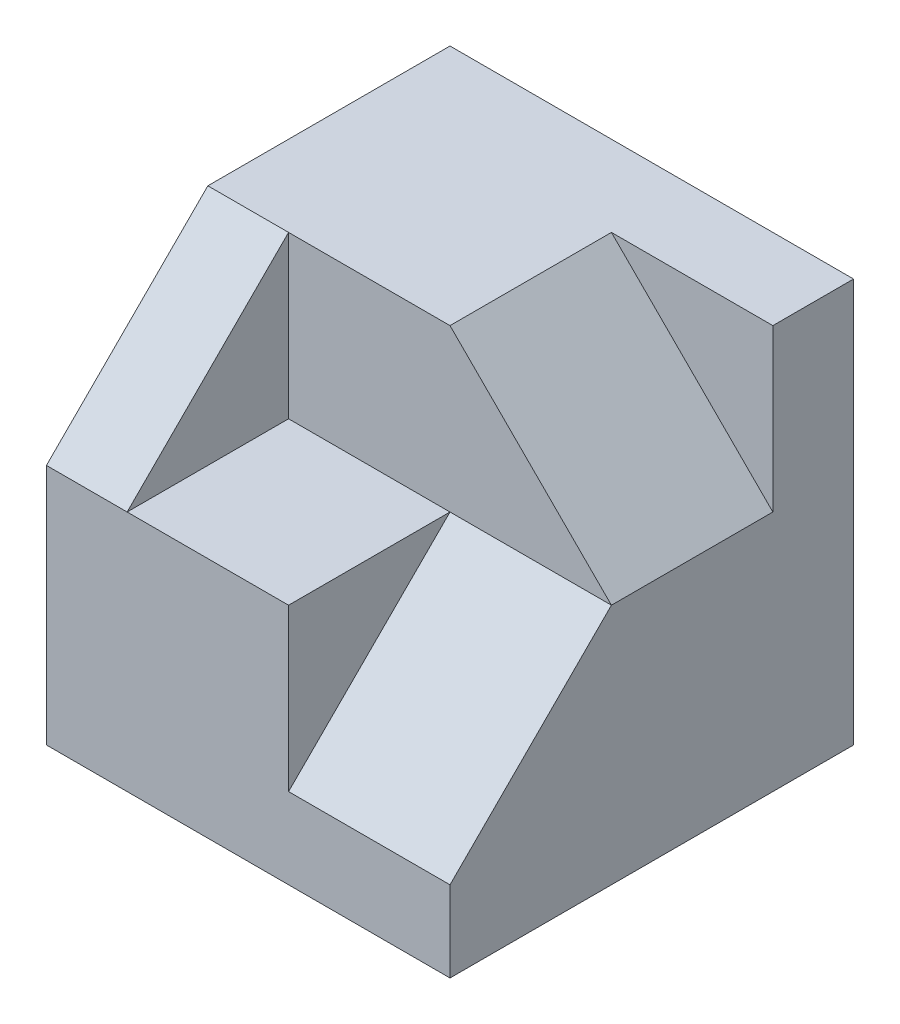
ISO-10303-21;
HEADER;
FILE_DESCRIPTION(('STEP AP214'),'2;1');
FILE_NAME('part.step','',(''),(''),'','','');
FILE_SCHEMA(('AUTOMOTIVE_DESIGN { 1 0 10303 214 1 1 1 1 }'));
ENDSEC;
DATA;
#1=APPLICATION_CONTEXT('core data for automotive mechanical design processes');
#2=APPLICATION_PROTOCOL_DEFINITION('international standard','automotive_design',2000,#1);
#3=PRODUCT_CONTEXT('',#1,'mechanical');
#4=PRODUCT('Part','Part','',(#3));
#5=PRODUCT_RELATED_PRODUCT_CATEGORY('part','',(#4));
#6=PRODUCT_DEFINITION_FORMATION('','',#4);
#7=PRODUCT_DEFINITION_CONTEXT('part definition',#1,'design');
#8=PRODUCT_DEFINITION('design','',#6,#7);
#9=PRODUCT_DEFINITION_SHAPE('','',#8);
#10=(LENGTH_UNIT() NAMED_UNIT(*) SI_UNIT(.MILLI.,.METRE.));
#11=(NAMED_UNIT(*) PLANE_ANGLE_UNIT() SI_UNIT($,.RADIAN.));
#12=(NAMED_UNIT(*) SI_UNIT($,.STERADIAN.) SOLID_ANGLE_UNIT());
#13=UNCERTAINTY_MEASURE_WITH_UNIT(LENGTH_MEASURE(1.E-05),#10,'distance_accuracy_value','');
#14=(GEOMETRIC_REPRESENTATION_CONTEXT(3) GLOBAL_UNCERTAINTY_ASSIGNED_CONTEXT((#13)) GLOBAL_UNIT_ASSIGNED_CONTEXT((#10,
#11,#12)) REPRESENTATION_CONTEXT('',''));
#15=CARTESIAN_POINT('',(0.,0.,0.));
#16=DIRECTION('',(0.,0.,1.));
#17=DIRECTION('',(1.,0.,0.));
#18=AXIS2_PLACEMENT_3D('',#15,#16,#17);
#19=CARTESIAN_POINT('',(0.,0.5,0.));
#20=DIRECTION('',(0.,1.,0.));
#21=DIRECTION('',(-1.,0.,0.));
#22=AXIS2_PLACEMENT_3D('',#19,#20,#21);
#23=PLANE('',#22);
#24=DIRECTION('',(1.,0.,0.));
#25=VECTOR('',#24,1.);
#26=CARTESIAN_POINT('',(-1.5,0.5,5.));
#27=LINE('',#26,#25);
#28=CARTESIAN_POINT('',(-1.5,0.499999999999999,5.));
#29=VERTEX_POINT('',#28);
#30=CARTESIAN_POINT('',(0.5,0.5,5.));
#31=VERTEX_POINT('',#30);
#32=EDGE_CURVE('E128',#29,#31,#27,.T.);
#33=ORIENTED_EDGE('',*,*,#32,.T.);
#34=DIRECTION('',(0.,0.,1.));
#35=VECTOR('',#34,1.);
#36=CARTESIAN_POINT('',(0.5,0.5,5.));
#37=LINE('',#36,#35);
#38=CARTESIAN_POINT('',(0.5,0.5,3.));
#39=VERTEX_POINT('',#38);
#40=EDGE_CURVE('E190',#39,#31,#37,.T.);
#41=ORIENTED_EDGE('',*,*,#40,.F.);
#42=DIRECTION('',(-1.,0.,0.));
#43=VECTOR('',#42,1.);
#44=CARTESIAN_POINT('',(2.5,0.5,3.));
#45=LINE('',#44,#43);
#46=CARTESIAN_POINT('',(-1.5,0.499999999999999,3.));
#47=VERTEX_POINT('',#46);
#48=EDGE_CURVE('E198',#39,#47,#45,.T.);
#49=ORIENTED_EDGE('',*,*,#48,.T.);
#50=DIRECTION('',(0.,0.,1.));
#51=VECTOR('',#50,1.);
#52=CARTESIAN_POINT('',(-1.5,0.499999999999999,3.));
#53=LINE('',#52,#51);
#54=EDGE_CURVE('E201',#47,#29,#53,.T.);
#55=ORIENTED_EDGE('',*,*,#54,.T.);
#56=EDGE_LOOP('',(#33,#41,#49,#55));
#57=FACE_BOUND('',#56,.T.);
#58=ADVANCED_FACE('F33',(#57),#23,.T.);
#59=CARTESIAN_POINT('',(-2.5,-2.5,5.));
#60=DIRECTION('',(1.,0.,0.));
#61=DIRECTION('',(0.,0.,-1.));
#62=AXIS2_PLACEMENT_3D('',#59,#60,#61);
#63=PLANE('',#62);
#64=DIRECTION('',(0.,-1.,0.));
#65=VECTOR('',#64,1.);
#66=CARTESIAN_POINT('',(-2.5,-2.5,5.));
#67=LINE('',#66,#65);
#68=CARTESIAN_POINT('',(-2.5,0.499999999999999,5.));
#69=VERTEX_POINT('',#68);
#70=CARTESIAN_POINT('',(-2.5,-2.5,5.));
#71=VERTEX_POINT('',#70);
#72=EDGE_CURVE('E124',#69,#71,#67,.T.);
#73=ORIENTED_EDGE('',*,*,#72,.F.);
#74=DIRECTION('',(0.,0.707106781186548,-0.707106781186548));
#75=VECTOR('',#74,1.);
#76=CARTESIAN_POINT('',(-2.5,2.5,3.));
#77=LINE('',#76,#75);
#78=CARTESIAN_POINT('',(-2.5,2.5,3.));
#79=VERTEX_POINT('',#78);
#80=EDGE_CURVE('E109',#69,#79,#77,.T.);
#81=ORIENTED_EDGE('',*,*,#80,.T.);
#82=DIRECTION('',(0.,0.,-1.));
#83=VECTOR('',#82,1.);
#84=CARTESIAN_POINT('',(-2.5,2.5,5.));
#85=LINE('',#84,#83);
#86=CARTESIAN_POINT('',(-2.5,2.5,0.));
#87=VERTEX_POINT('',#86);
#88=EDGE_CURVE('E145',#79,#87,#85,.T.);
#89=ORIENTED_EDGE('',*,*,#88,.T.);
#90=DIRECTION('',(0.,-1.,0.));
#91=VECTOR('',#90,1.);
#92=CARTESIAN_POINT('',(-2.5,-2.5,0.));
#93=LINE('',#92,#91);
#94=CARTESIAN_POINT('',(-2.5,-2.5,0.));
#95=VERTEX_POINT('',#94);
#96=EDGE_CURVE('E146',#87,#95,#93,.T.);
#97=ORIENTED_EDGE('',*,*,#96,.T.);
#98=DIRECTION('',(0.,0.,-1.));
#99=VECTOR('',#98,1.);
#100=CARTESIAN_POINT('',(-2.5,-2.5,5.));
#101=LINE('',#100,#99);
#102=EDGE_CURVE('E11',#71,#95,#101,.T.);
#103=ORIENTED_EDGE('',*,*,#102,.F.);
#104=EDGE_LOOP('',(#73,#81,#89,#97,#103));
#105=FACE_BOUND('',#104,.T.);
#106=ADVANCED_FACE('F35',(#105),#63,.F.);
#107=CARTESIAN_POINT('',(2.5,-2.5,5.));
#108=DIRECTION('',(0.,1.,0.));
#109=DIRECTION('',(-1.,0.,0.));
#110=AXIS2_PLACEMENT_3D('',#107,#108,#109);
#111=PLANE('',#110);
#112=DIRECTION('',(1.,0.,0.));
#113=VECTOR('',#112,1.);
#114=CARTESIAN_POINT('',(2.5,-2.5,0.));
#115=LINE('',#114,#113);
#116=CARTESIAN_POINT('',(2.5,-2.5,0.));
#117=VERTEX_POINT('',#116);
#118=EDGE_CURVE('E148',#95,#117,#115,.T.);
#119=ORIENTED_EDGE('',*,*,#118,.T.);
#120=DIRECTION('',(0.,0.,-1.));
#121=VECTOR('',#120,1.);
#122=CARTESIAN_POINT('',(2.5,-2.5,5.));
#123=LINE('',#122,#121);
#124=CARTESIAN_POINT('',(2.5,-2.5,5.));
#125=VERTEX_POINT('',#124);
#126=EDGE_CURVE('E41',#125,#117,#123,.T.);
#127=ORIENTED_EDGE('',*,*,#126,.F.);
#128=DIRECTION('',(1.,0.,0.));
#129=VECTOR('',#128,1.);
#130=CARTESIAN_POINT('',(2.5,-2.5,5.));
#131=LINE('',#130,#129);
#132=EDGE_CURVE('E132',#71,#125,#131,.T.);
#133=ORIENTED_EDGE('',*,*,#132,.F.);
#134=ORIENTED_EDGE('',*,*,#102,.T.);
#135=EDGE_LOOP('',(#119,#127,#133,#134));
#136=FACE_BOUND('',#135,.T.);
#137=ADVANCED_FACE('F225',(#136),#111,.F.);
#138=CARTESIAN_POINT('',(2.5,-2.5,5.));
#139=DIRECTION('',(-1.,0.,0.));
#140=DIRECTION('',(0.,0.,1.));
#141=AXIS2_PLACEMENT_3D('',#138,#139,#140);
#142=PLANE('',#141);
#143=DIRECTION('',(0.,1.,0.));
#144=VECTOR('',#143,1.);
#145=CARTESIAN_POINT('',(2.5,0.5,1.));
#146=LINE('',#145,#144);
#147=CARTESIAN_POINT('',(2.5,0.5,1.));
#148=VERTEX_POINT('',#147);
#149=CARTESIAN_POINT('',(2.5,2.5,1.));
#150=VERTEX_POINT('',#149);
#151=EDGE_CURVE('E175',#148,#150,#146,.T.);
#152=ORIENTED_EDGE('',*,*,#151,.F.);
#153=DIRECTION('',(0.,0.,1.));
#154=VECTOR('',#153,1.);
#155=CARTESIAN_POINT('',(2.5,0.5,1.));
#156=LINE('',#155,#154);
#157=CARTESIAN_POINT('',(2.5,0.5,3.));
#158=VERTEX_POINT('',#157);
#159=EDGE_CURVE('E176',#148,#158,#156,.T.);
#160=ORIENTED_EDGE('',*,*,#159,.T.);
#161=DIRECTION('',(0.,0.707106781186548,-0.707106781186548));
#162=VECTOR('',#161,1.);
#163=CARTESIAN_POINT('',(2.5,0.5,3.));
#164=LINE('',#163,#162);
#165=CARTESIAN_POINT('',(2.5,-1.5,5.));
#166=VERTEX_POINT('',#165);
#167=EDGE_CURVE('E188',#166,#158,#164,.T.);
#168=ORIENTED_EDGE('',*,*,#167,.F.);
#169=DIRECTION('',(0.,1.,0.));
#170=VECTOR('',#169,1.);
#171=CARTESIAN_POINT('',(2.5,-2.5,5.));
#172=LINE('',#171,#170);
#173=EDGE_CURVE('E135',#125,#166,#172,.T.);
#174=ORIENTED_EDGE('',*,*,#173,.F.);
#175=ORIENTED_EDGE('',*,*,#126,.T.);
#176=DIRECTION('',(0.,1.,0.));
#177=VECTOR('',#176,1.);
#178=CARTESIAN_POINT('',(2.5,-2.5,0.));
#179=LINE('',#178,#177);
#180=CARTESIAN_POINT('',(2.5,2.5,0.));
#181=VERTEX_POINT('',#180);
#182=EDGE_CURVE('E138',#117,#181,#179,.T.);
#183=ORIENTED_EDGE('',*,*,#182,.T.);
#184=DIRECTION('',(0.,0.,-1.));
#185=VECTOR('',#184,1.);
#186=CARTESIAN_POINT('',(2.5,2.5,5.));
#187=LINE('',#186,#185);
#188=EDGE_CURVE('E154',#150,#181,#187,.T.);
#189=ORIENTED_EDGE('',*,*,#188,.F.);
#190=EDGE_LOOP('',(#152,#160,#168,#174,#175,#183,#189));
#191=FACE_BOUND('',#190,.T.);
#192=ADVANCED_FACE('F161',(#191),#142,.F.);
#193=CARTESIAN_POINT('',(2.5,2.5,5.));
#194=DIRECTION('',(0.,-1.,0.));
#195=DIRECTION('',(1.,0.,0.));
#196=AXIS2_PLACEMENT_3D('',#193,#194,#195);
#197=PLANE('',#196);
#198=ORIENTED_EDGE('',*,*,#88,.F.);
#199=DIRECTION('',(1.,0.,0.));
#200=VECTOR('',#199,1.);
#201=CARTESIAN_POINT('',(-2.5,2.5,3.));
#202=LINE('',#201,#200);
#203=CARTESIAN_POINT('',(-1.5,2.5,3.));
#204=VERTEX_POINT('',#203);
#205=EDGE_CURVE('E115',#79,#204,#202,.T.);
#206=ORIENTED_EDGE('',*,*,#205,.T.);
#207=DIRECTION('',(1.,0.,0.));
#208=VECTOR('',#207,1.);
#209=CARTESIAN_POINT('',(-1.5,2.5,3.));
#210=LINE('',#209,#208);
#211=CARTESIAN_POINT('',(0.5,2.5,3.));
#212=VERTEX_POINT('',#211);
#213=EDGE_CURVE('E149',#204,#212,#210,.T.);
#214=ORIENTED_EDGE('',*,*,#213,.T.);
#215=DIRECTION('',(0.,0.,1.));
#216=VECTOR('',#215,1.);
#217=CARTESIAN_POINT('',(0.5,2.5,1.));
#218=LINE('',#217,#216);
#219=CARTESIAN_POINT('',(0.5,2.5,1.));
#220=VERTEX_POINT('',#219);
#221=EDGE_CURVE('E48',#220,#212,#218,.T.);
#222=ORIENTED_EDGE('',*,*,#221,.F.);
#223=DIRECTION('',(-1.,0.,0.));
#224=VECTOR('',#223,1.);
#225=CARTESIAN_POINT('',(2.5,2.5,1.));
#226=LINE('',#225,#224);
#227=EDGE_CURVE('E173',#150,#220,#226,.T.);
#228=ORIENTED_EDGE('',*,*,#227,.F.);
#229=ORIENTED_EDGE('',*,*,#188,.T.);
#230=DIRECTION('',(-1.,0.,0.));
#231=VECTOR('',#230,1.);
#232=CARTESIAN_POINT('',(2.5,2.5,0.));
#233=LINE('',#232,#231);
#234=EDGE_CURVE('E133',#181,#87,#233,.T.);
#235=ORIENTED_EDGE('',*,*,#234,.T.);
#236=EDGE_LOOP('',(#198,#206,#214,#222,#228,#229,#235));
#237=FACE_BOUND('',#236,.T.);
#238=ADVANCED_FACE('F170',(#237),#197,.F.);
#239=CARTESIAN_POINT('',(0.,0.,5.));
#240=DIRECTION('',(0.,0.,1.));
#241=DIRECTION('',(1.,0.,0.));
#242=AXIS2_PLACEMENT_3D('',#239,#240,#241);
#243=PLANE('',#242);
#244=DIRECTION('',(1.,0.,0.));
#245=VECTOR('',#244,1.);
#246=CARTESIAN_POINT('',(-2.5,0.499999999999999,5.));
#247=LINE('',#246,#245);
#248=EDGE_CURVE('E112',#69,#29,#247,.T.);
#249=ORIENTED_EDGE('',*,*,#248,.F.);
#250=ORIENTED_EDGE('',*,*,#72,.T.);
#251=ORIENTED_EDGE('',*,*,#132,.T.);
#252=ORIENTED_EDGE('',*,*,#173,.T.);
#253=DIRECTION('',(1.,0.,0.));
#254=VECTOR('',#253,1.);
#255=CARTESIAN_POINT('',(0.5,-1.5,5.));
#256=LINE('',#255,#254);
#257=CARTESIAN_POINT('',(0.5,-1.5,5.));
#258=VERTEX_POINT('',#257);
#259=EDGE_CURVE('E195',#258,#166,#256,.T.);
#260=ORIENTED_EDGE('',*,*,#259,.F.);
#261=DIRECTION('',(0.,-1.,0.));
#262=VECTOR('',#261,1.);
#263=CARTESIAN_POINT('',(0.5,-1.5,5.));
#264=LINE('',#263,#262);
#265=EDGE_CURVE('E192',#31,#258,#264,.T.);
#266=ORIENTED_EDGE('',*,*,#265,.F.);
#267=ORIENTED_EDGE('',*,*,#32,.F.);
#268=EDGE_LOOP('',(#249,#250,#251,#252,#260,#266,#267));
#269=FACE_BOUND('',#268,.T.);
#270=ADVANCED_FACE('F123',(#269),#243,.T.);
#271=CARTESIAN_POINT('',(0.,0.,0.));
#272=DIRECTION('',(0.,0.,1.));
#273=DIRECTION('',(1.,0.,0.));
#274=AXIS2_PLACEMENT_3D('',#271,#272,#273);
#275=PLANE('',#274);
#276=ORIENTED_EDGE('',*,*,#96,.F.);
#277=ORIENTED_EDGE('',*,*,#234,.F.);
#278=ORIENTED_EDGE('',*,*,#182,.F.);
#279=ORIENTED_EDGE('',*,*,#118,.F.);
#280=EDGE_LOOP('',(#276,#277,#278,#279));
#281=FACE_BOUND('',#280,.T.);
#282=ADVANCED_FACE('F168',(#281),#275,.F.);
#283=CARTESIAN_POINT('',(-1.5,0.,0.));
#284=DIRECTION('',(1.,0.,0.));
#285=DIRECTION('',(0.,0.,-1.));
#286=AXIS2_PLACEMENT_3D('',#283,#284,#285);
#287=PLANE('',#286);
#288=DIRECTION('',(0.,0.707106781186548,-0.707106781186548));
#289=VECTOR('',#288,1.);
#290=CARTESIAN_POINT('',(-1.5,2.5,3.));
#291=LINE('',#290,#289);
#292=EDGE_CURVE('E119',#29,#204,#291,.T.);
#293=ORIENTED_EDGE('',*,*,#292,.F.);
#294=ORIENTED_EDGE('',*,*,#54,.F.);
#295=DIRECTION('',(0.,1.,0.));
#296=VECTOR('',#295,1.);
#297=CARTESIAN_POINT('',(-1.5,0.499999999999999,3.));
#298=LINE('',#297,#296);
#299=EDGE_CURVE('E204',#47,#204,#298,.T.);
#300=ORIENTED_EDGE('',*,*,#299,.T.);
#301=EDGE_LOOP('',(#293,#294,#300));
#302=FACE_BOUND('',#301,.T.);
#303=ADVANCED_FACE('F214',(#302),#287,.T.);
#304=CARTESIAN_POINT('',(2.5,0.5,3.));
#305=DIRECTION('',(0.,0.,-1.));
#306=DIRECTION('',(-1.,0.,0.));
#307=AXIS2_PLACEMENT_3D('',#304,#305,#306);
#308=PLANE('',#307);
#309=EDGE_CURVE('E199',#158,#39,#45,.T.);
#310=ORIENTED_EDGE('',*,*,#309,.F.);
#311=DIRECTION('',(0.707106781186548,-0.707106781186548,0.));
#312=VECTOR('',#311,1.);
#313=CARTESIAN_POINT('',(0.5,2.5,3.));
#314=LINE('',#313,#312);
#315=EDGE_CURVE('E186',#212,#158,#314,.T.);
#316=ORIENTED_EDGE('',*,*,#315,.F.);
#317=ORIENTED_EDGE('',*,*,#213,.F.);
#318=ORIENTED_EDGE('',*,*,#299,.F.);
#319=ORIENTED_EDGE('',*,*,#48,.F.);
#320=EDGE_LOOP('',(#310,#316,#317,#318,#319));
#321=FACE_BOUND('',#320,.T.);
#322=ADVANCED_FACE('F221',(#321),#308,.F.);
#323=CARTESIAN_POINT('',(0.5,0.5,3.));
#324=DIRECTION('',(0.,-0.707106781186547,-0.707106781186547));
#325=DIRECTION('',(0.,0.707106781186548,-0.707106781186548));
#326=AXIS2_PLACEMENT_3D('',#323,#324,#325);
#327=PLANE('',#326);
#328=ORIENTED_EDGE('',*,*,#167,.T.);
#329=ORIENTED_EDGE('',*,*,#309,.T.);
#330=DIRECTION('',(0.,0.707106781186548,-0.707106781186548));
#331=VECTOR('',#330,1.);
#332=CARTESIAN_POINT('',(0.5,0.5,3.));
#333=LINE('',#332,#331);
#334=EDGE_CURVE('E56',#258,#39,#333,.T.);
#335=ORIENTED_EDGE('',*,*,#334,.F.);
#336=ORIENTED_EDGE('',*,*,#259,.T.);
#337=EDGE_LOOP('',(#328,#329,#335,#336));
#338=FACE_BOUND('',#337,.T.);
#339=ADVANCED_FACE('F223',(#338),#327,.F.);
#340=CARTESIAN_POINT('',(0.5,0.,0.));
#341=DIRECTION('',(1.,0.,0.));
#342=DIRECTION('',(0.,0.,-1.));
#343=AXIS2_PLACEMENT_3D('',#340,#341,#342);
#344=PLANE('',#343);
#345=ORIENTED_EDGE('',*,*,#40,.T.);
#346=ORIENTED_EDGE('',*,*,#265,.T.);
#347=ORIENTED_EDGE('',*,*,#334,.T.);
#348=EDGE_LOOP('',(#345,#346,#347));
#349=FACE_BOUND('',#348,.T.);
#350=ADVANCED_FACE('F277',(#349),#344,.T.);
#351=CARTESIAN_POINT('',(0.5,2.5,1.));
#352=DIRECTION('',(-0.707106781186547,-0.707106781186548,0.));
#353=DIRECTION('',(0.707106781186548,-0.707106781186547,0.));
#354=AXIS2_PLACEMENT_3D('',#351,#352,#353);
#355=PLANE('',#354);
#356=ORIENTED_EDGE('',*,*,#315,.T.);
#357=ORIENTED_EDGE('',*,*,#159,.F.);
#358=DIRECTION('',(0.707106781186548,-0.707106781186548,0.));
#359=VECTOR('',#358,1.);
#360=CARTESIAN_POINT('',(0.5,2.5,1.));
#361=LINE('',#360,#359);
#362=EDGE_CURVE('E180',#220,#148,#361,.T.);
#363=ORIENTED_EDGE('',*,*,#362,.F.);
#364=ORIENTED_EDGE('',*,*,#221,.T.);
#365=EDGE_LOOP('',(#356,#357,#363,#364));
#366=FACE_BOUND('',#365,.T.);
#367=ADVANCED_FACE('F218',(#366),#355,.F.);
#368=CARTESIAN_POINT('',(0.,0.,1.));
#369=DIRECTION('',(0.,0.,-1.));
#370=DIRECTION('',(-1.,0.,0.));
#371=AXIS2_PLACEMENT_3D('',#368,#369,#370);
#372=PLANE('',#371);
#373=ORIENTED_EDGE('',*,*,#227,.T.);
#374=ORIENTED_EDGE('',*,*,#362,.T.);
#375=ORIENTED_EDGE('',*,*,#151,.T.);
#376=EDGE_LOOP('',(#373,#374,#375));
#377=FACE_BOUND('',#376,.T.);
#378=ADVANCED_FACE('F217',(#377),#372,.F.);
#379=CARTESIAN_POINT('',(-2.5,2.5,3.));
#380=DIRECTION('',(0.,-0.707106781186547,-0.707106781186547));
#381=DIRECTION('',(0.,0.707106781186548,-0.707106781186548));
#382=AXIS2_PLACEMENT_3D('',#379,#380,#381);
#383=PLANE('',#382);
#384=ORIENTED_EDGE('',*,*,#292,.T.);
#385=ORIENTED_EDGE('',*,*,#205,.F.);
#386=ORIENTED_EDGE('',*,*,#80,.F.);
#387=ORIENTED_EDGE('',*,*,#248,.T.);
#388=EDGE_LOOP('',(#384,#385,#386,#387));
#389=FACE_BOUND('',#388,.T.);
#390=ADVANCED_FACE('F111',(#389),#383,.F.);
#391=CLOSED_SHELL('',(#58,#106,#137,#192,#238,#270,#282,#303,#322,#339,#350,#367,#378,#390));
#392=MANIFOLD_SOLID_BREP('B2',#391);
#393=ADVANCED_BREP_SHAPE_REPRESENTATION('',(#18,#392),#14);
#394=SHAPE_DEFINITION_REPRESENTATION(#9,#393);
ENDSEC;
END-ISO-10303-21;
